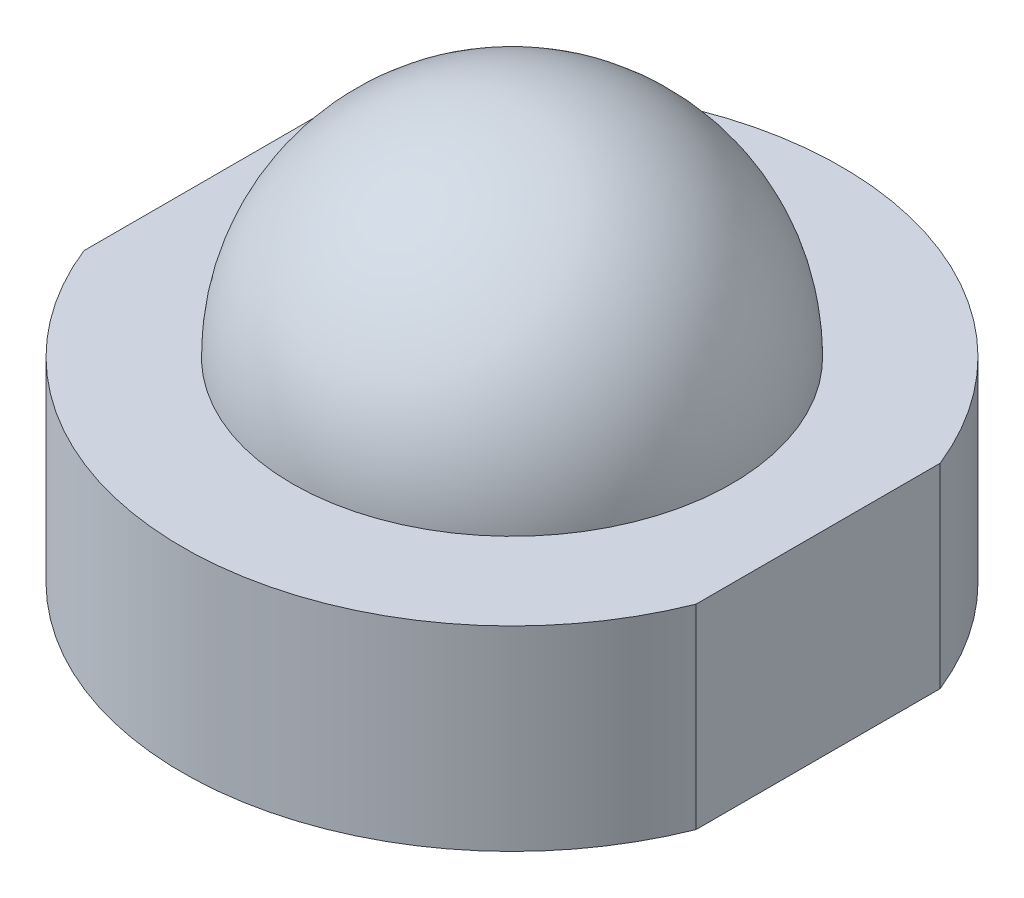
ISO-10303-21;
HEADER;
FILE_DESCRIPTION(('STEP AP214'),'2;1');
FILE_NAME('part.step','',(''),(''),'','','');
FILE_SCHEMA(('AUTOMOTIVE_DESIGN { 1 0 10303 214 1 1 1 1 }'));
ENDSEC;
DATA;
#1=APPLICATION_CONTEXT('core data for automotive mechanical design processes');
#2=APPLICATION_PROTOCOL_DEFINITION('international standard','automotive_design',2000,#1);
#3=PRODUCT_CONTEXT('',#1,'mechanical');
#4=PRODUCT('Part','Part','',(#3));
#5=PRODUCT_RELATED_PRODUCT_CATEGORY('part','',(#4));
#6=PRODUCT_DEFINITION_FORMATION('','',#4);
#7=PRODUCT_DEFINITION_CONTEXT('part definition',#1,'design');
#8=PRODUCT_DEFINITION('design','',#6,#7);
#9=PRODUCT_DEFINITION_SHAPE('','',#8);
#10=(LENGTH_UNIT() NAMED_UNIT(*) SI_UNIT(.MILLI.,.METRE.));
#11=(NAMED_UNIT(*) PLANE_ANGLE_UNIT() SI_UNIT($,.RADIAN.));
#12=(NAMED_UNIT(*) SI_UNIT($,.STERADIAN.) SOLID_ANGLE_UNIT());
#13=UNCERTAINTY_MEASURE_WITH_UNIT(LENGTH_MEASURE(1.E-05),#10,'distance_accuracy_value','');
#14=(GEOMETRIC_REPRESENTATION_CONTEXT(3) GLOBAL_UNCERTAINTY_ASSIGNED_CONTEXT((#13)) GLOBAL_UNIT_ASSIGNED_CONTEXT((#10,
#11,#12)) REPRESENTATION_CONTEXT('',''));
#15=CARTESIAN_POINT('',(0.,0.,0.));
#16=DIRECTION('',(0.,0.,1.));
#17=DIRECTION('',(1.,0.,0.));
#18=AXIS2_PLACEMENT_3D('',#15,#16,#17);
#19=CARTESIAN_POINT('',(0.,2.4,0.));
#20=DIRECTION('',(0.,-1.,0.));
#21=DIRECTION('',(0.,0.,-1.));
#22=AXIS2_PLACEMENT_3D('',#19,#20,#21);
#23=CYLINDRICAL_SURFACE('',#22,4.05);
#24=CARTESIAN_POINT('',(0.,0.,0.));
#25=DIRECTION('',(0.,1.,0.));
#26=DIRECTION('',(0.,0.,1.));
#27=AXIS2_PLACEMENT_3D('',#24,#25,#26);
#28=CIRCLE('',#27,4.05);
#29=CARTESIAN_POINT('',(-3.76198086119534,0.,1.5));
#30=VERTEX_POINT('',#29);
#31=CARTESIAN_POINT('',(3.76198086119534,0.,1.5));
#32=VERTEX_POINT('',#31);
#33=EDGE_CURVE('E102',#30,#32,#28,.T.);
#34=ORIENTED_EDGE('',*,*,#33,.T.);
#35=DIRECTION('',(0.,-1.,0.));
#36=VECTOR('',#35,1.);
#37=CARTESIAN_POINT('',(3.76198086119534,2.4,1.5));
#38=LINE('',#37,#36);
#39=CARTESIAN_POINT('',(3.76198086119534,2.4,1.5));
#40=VERTEX_POINT('',#39);
#41=EDGE_CURVE('E46',#40,#32,#38,.T.);
#42=ORIENTED_EDGE('',*,*,#41,.F.);
#43=CARTESIAN_POINT('',(0.,2.4,0.));
#44=DIRECTION('',(0.,1.,0.));
#45=DIRECTION('',(0.,0.,1.));
#46=AXIS2_PLACEMENT_3D('',#43,#44,#45);
#47=CIRCLE('',#46,4.05);
#48=CARTESIAN_POINT('',(-3.76198086119534,2.4,1.5));
#49=VERTEX_POINT('',#48);
#50=EDGE_CURVE('E81',#49,#40,#47,.T.);
#51=ORIENTED_EDGE('',*,*,#50,.F.);
#52=DIRECTION('',(0.,-1.,0.));
#53=VECTOR('',#52,1.);
#54=CARTESIAN_POINT('',(-3.76198086119534,2.4,1.5));
#55=LINE('',#54,#53);
#56=EDGE_CURVE('E101',#49,#30,#55,.T.);
#57=ORIENTED_EDGE('',*,*,#56,.T.);
#58=EDGE_LOOP('',(#34,#42,#51,#57));
#59=FACE_BOUND('',#58,.T.);
#60=ADVANCED_FACE('F37',(#59),#23,.T.);
#61=CARTESIAN_POINT('',(3.76198086119534,2.4,0.));
#62=DIRECTION('',(1.,0.,0.));
#63=DIRECTION('',(0.,0.,-1.));
#64=AXIS2_PLACEMENT_3D('',#61,#62,#63);
#65=PLANE('',#64);
#66=DIRECTION('',(0.,0.,1.));
#67=VECTOR('',#66,1.);
#68=CARTESIAN_POINT('',(3.76198086119534,0.,0.));
#69=LINE('',#68,#67);
#70=CARTESIAN_POINT('',(3.76198086119534,0.,-1.5));
#71=VERTEX_POINT('',#70);
#72=EDGE_CURVE('E91',#71,#32,#69,.T.);
#73=ORIENTED_EDGE('',*,*,#72,.F.);
#74=DIRECTION('',(0.,-1.,0.));
#75=VECTOR('',#74,1.);
#76=CARTESIAN_POINT('',(3.76198086119534,2.4,-1.5));
#77=LINE('',#76,#75);
#78=CARTESIAN_POINT('',(3.76198086119534,2.4,-1.5));
#79=VERTEX_POINT('',#78);
#80=EDGE_CURVE('E87',#79,#71,#77,.T.);
#81=ORIENTED_EDGE('',*,*,#80,.F.);
#82=DIRECTION('',(0.,0.,1.));
#83=VECTOR('',#82,1.);
#84=CARTESIAN_POINT('',(3.76198086119534,2.4,0.));
#85=LINE('',#84,#83);
#86=EDGE_CURVE('E89',#79,#40,#85,.T.);
#87=ORIENTED_EDGE('',*,*,#86,.T.);
#88=ORIENTED_EDGE('',*,*,#41,.T.);
#89=EDGE_LOOP('',(#73,#81,#87,#88));
#90=FACE_BOUND('',#89,.T.);
#91=ADVANCED_FACE('F39',(#90),#65,.T.);
#92=CARTESIAN_POINT('',(-3.76198086119534,0.,-1.5));
#93=VERTEX_POINT('',#92);
#94=EDGE_CURVE('E70',#71,#93,#28,.T.);
#95=ORIENTED_EDGE('',*,*,#94,.T.);
#96=DIRECTION('',(0.,-1.,0.));
#97=VECTOR('',#96,1.);
#98=CARTESIAN_POINT('',(-3.76198086119534,2.4,-1.5));
#99=LINE('',#98,#97);
#100=CARTESIAN_POINT('',(-3.76198086119534,2.4,-1.5));
#101=VERTEX_POINT('',#100);
#102=EDGE_CURVE('E92',#101,#93,#99,.T.);
#103=ORIENTED_EDGE('',*,*,#102,.F.);
#104=EDGE_CURVE('E94',#79,#101,#47,.T.);
#105=ORIENTED_EDGE('',*,*,#104,.F.);
#106=ORIENTED_EDGE('',*,*,#80,.T.);
#107=EDGE_LOOP('',(#95,#103,#105,#106));
#108=FACE_BOUND('',#107,.T.);
#109=ADVANCED_FACE('F95',(#108),#23,.T.);
#110=CARTESIAN_POINT('',(-3.76198086119534,2.4,0.));
#111=DIRECTION('',(1.,0.,0.));
#112=DIRECTION('',(0.,0.,-1.));
#113=AXIS2_PLACEMENT_3D('',#110,#111,#112);
#114=PLANE('',#113);
#115=DIRECTION('',(0.,0.,1.));
#116=VECTOR('',#115,1.);
#117=CARTESIAN_POINT('',(-3.76198086119534,0.,0.));
#118=LINE('',#117,#116);
#119=EDGE_CURVE('E76',#93,#30,#118,.T.);
#120=ORIENTED_EDGE('',*,*,#119,.T.);
#121=ORIENTED_EDGE('',*,*,#56,.F.);
#122=DIRECTION('',(0.,0.,1.));
#123=VECTOR('',#122,1.);
#124=CARTESIAN_POINT('',(-3.76198086119534,2.4,0.));
#125=LINE('',#124,#123);
#126=EDGE_CURVE('E54',#101,#49,#125,.T.);
#127=ORIENTED_EDGE('',*,*,#126,.F.);
#128=ORIENTED_EDGE('',*,*,#102,.T.);
#129=EDGE_LOOP('',(#120,#121,#127,#128));
#130=FACE_BOUND('',#129,.T.);
#131=ADVANCED_FACE('F121',(#130),#114,.F.);
#132=CARTESIAN_POINT('',(0.,2.4,0.));
#133=DIRECTION('',(0.,1.,0.));
#134=DIRECTION('',(0.,0.,1.));
#135=AXIS2_PLACEMENT_3D('',#132,#133,#134);
#136=PLANE('',#135);
#137=CARTESIAN_POINT('',(0.,2.4,0.));
#138=DIRECTION('',(0.,1.,0.));
#139=DIRECTION('',(0.,0.,1.));
#140=AXIS2_PLACEMENT_3D('',#137,#138,#139);
#141=CIRCLE('',#140,2.7);
#142=CARTESIAN_POINT('',(0.,2.4,2.7));
#143=VERTEX_POINT('',#142);
#144=EDGE_CURVE('E11',#143,#143,#141,.T.);
#145=ORIENTED_EDGE('',*,*,#144,.F.);
#146=EDGE_LOOP('',(#145));
#147=FACE_BOUND('',#146,.T.);
#148=ORIENTED_EDGE('',*,*,#50,.T.);
#149=ORIENTED_EDGE('',*,*,#86,.F.);
#150=ORIENTED_EDGE('',*,*,#104,.T.);
#151=ORIENTED_EDGE('',*,*,#126,.T.);
#152=EDGE_LOOP('',(#148,#149,#150,#151));
#153=FACE_BOUND('',#152,.T.);
#154=ADVANCED_FACE('F97',(#147,#153),#136,.T.);
#155=CARTESIAN_POINT('',(0.,0.,0.));
#156=DIRECTION('',(0.,1.,0.));
#157=DIRECTION('',(0.,0.,1.));
#158=AXIS2_PLACEMENT_3D('',#155,#156,#157);
#159=PLANE('',#158);
#160=ORIENTED_EDGE('',*,*,#33,.F.);
#161=ORIENTED_EDGE('',*,*,#119,.F.);
#162=ORIENTED_EDGE('',*,*,#94,.F.);
#163=ORIENTED_EDGE('',*,*,#72,.T.);
#164=EDGE_LOOP('',(#160,#161,#162,#163));
#165=FACE_BOUND('',#164,.T.);
#166=ADVANCED_FACE('F111',(#165),#159,.F.);
#167=CARTESIAN_POINT('',(0.,2.4,0.));
#168=DIRECTION('',(0.,-1.,0.));
#169=DIRECTION('',(0.,0.,-1.));
#170=AXIS2_PLACEMENT_3D('',#167,#168,#169);
#171=SPHERICAL_SURFACE('',#170,2.7);
#172=ORIENTED_EDGE('',*,*,#144,.T.);
#173=EDGE_LOOP('',(#172));
#174=FACE_BOUND('',#173,.T.);
#175=ADVANCED_FACE('F113',(#174),#171,.T.);
#176=CLOSED_SHELL('',(#60,#91,#109,#131,#154,#166,#175));
#177=MANIFOLD_SOLID_BREP('B2',#176);
#178=ADVANCED_BREP_SHAPE_REPRESENTATION('',(#18,#177),#14);
#179=SHAPE_DEFINITION_REPRESENTATION(#9,#178);
ENDSEC;
END-ISO-10303-21;
